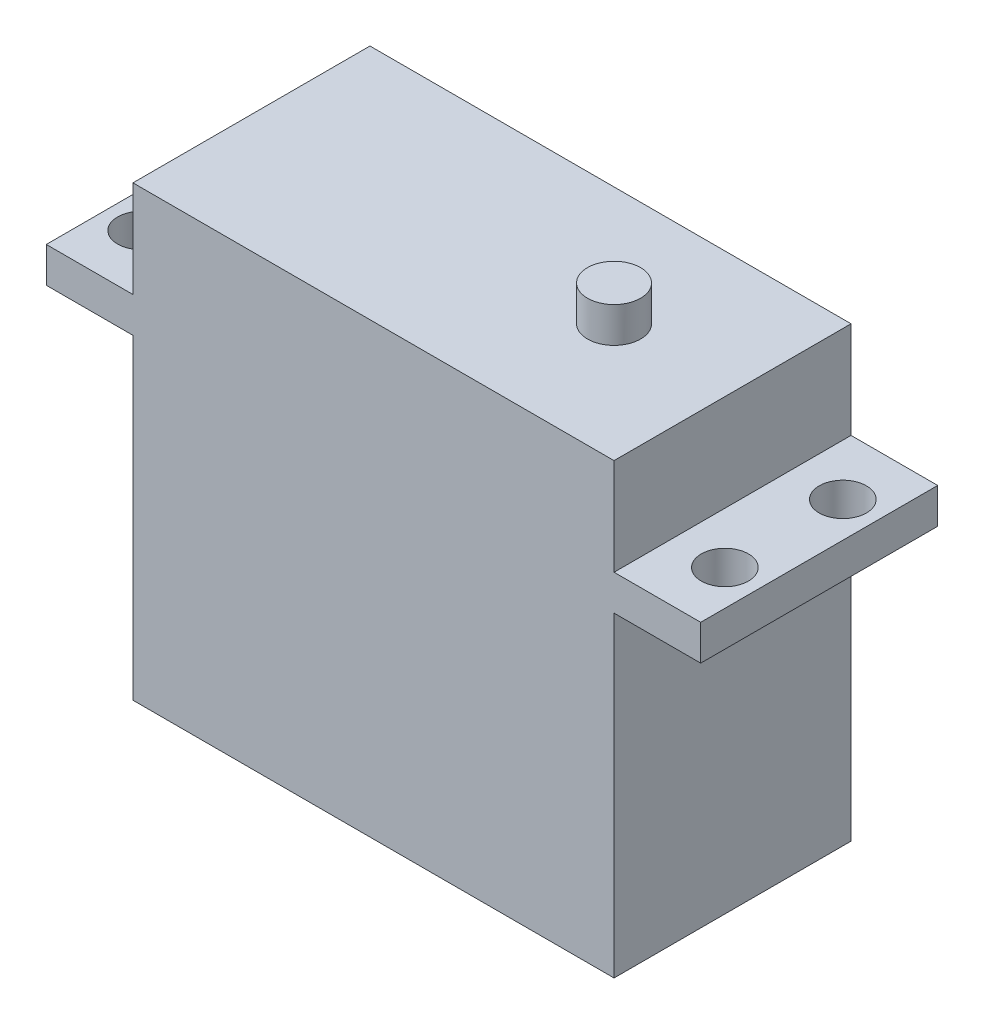
ISO-10303-21;
HEADER;
FILE_DESCRIPTION(('STEP AP214'),'2;1');
FILE_NAME('part.step','',(''),(''),'','','');
FILE_SCHEMA(('AUTOMOTIVE_DESIGN { 1 0 10303 214 1 1 1 1 }'));
ENDSEC;
DATA;
#1=APPLICATION_CONTEXT('core data for automotive mechanical design processes');
#2=APPLICATION_PROTOCOL_DEFINITION('international standard','automotive_design',2000,#1);
#3=PRODUCT_CONTEXT('',#1,'mechanical');
#4=PRODUCT('Part','Part','',(#3));
#5=PRODUCT_RELATED_PRODUCT_CATEGORY('part','',(#4));
#6=PRODUCT_DEFINITION_FORMATION('','',#4);
#7=PRODUCT_DEFINITION_CONTEXT('part definition',#1,'design');
#8=PRODUCT_DEFINITION('design','',#6,#7);
#9=PRODUCT_DEFINITION_SHAPE('','',#8);
#10=(LENGTH_UNIT() NAMED_UNIT(*) SI_UNIT(.MILLI.,.METRE.));
#11=(NAMED_UNIT(*) PLANE_ANGLE_UNIT() SI_UNIT($,.RADIAN.));
#12=(NAMED_UNIT(*) SI_UNIT($,.STERADIAN.) SOLID_ANGLE_UNIT());
#13=UNCERTAINTY_MEASURE_WITH_UNIT(LENGTH_MEASURE(1.E-05),#10,'distance_accuracy_value','');
#14=(GEOMETRIC_REPRESENTATION_CONTEXT(3) GLOBAL_UNCERTAINTY_ASSIGNED_CONTEXT((#13)) GLOBAL_UNIT_ASSIGNED_CONTEXT((#10,
#11,#12)) REPRESENTATION_CONTEXT('',''));
#15=CARTESIAN_POINT('',(0.,0.,0.));
#16=DIRECTION('',(0.,0.,1.));
#17=DIRECTION('',(1.,0.,0.));
#18=AXIS2_PLACEMENT_3D('',#15,#16,#17);
#19=CARTESIAN_POINT('',(0.,0.,20.1));
#20=DIRECTION('',(1.,0.,0.));
#21=DIRECTION('',(0.,0.,-1.));
#22=AXIS2_PLACEMENT_3D('',#19,#20,#21);
#23=PLANE('',#22);
#24=DIRECTION('',(0.,-1.,0.));
#25=VECTOR('',#24,1.);
#26=CARTESIAN_POINT('',(0.,0.,20.1));
#27=LINE('',#26,#25);
#28=CARTESIAN_POINT('',(0.,26.8,20.1));
#29=VERTEX_POINT('',#28);
#30=CARTESIAN_POINT('',(0.,0.,20.1));
#31=VERTEX_POINT('',#30);
#32=EDGE_CURVE('E183',#29,#31,#27,.T.);
#33=ORIENTED_EDGE('',*,*,#32,.F.);
#34=DIRECTION('',(0.,0.,-1.));
#35=VECTOR('',#34,1.);
#36=CARTESIAN_POINT('',(0.,26.8,20.1));
#37=LINE('',#36,#35);
#38=CARTESIAN_POINT('',(0.,26.8,0.));
#39=VERTEX_POINT('',#38);
#40=EDGE_CURVE('E173',#29,#39,#37,.T.);
#41=ORIENTED_EDGE('',*,*,#40,.T.);
#42=DIRECTION('',(0.,-1.,0.));
#43=VECTOR('',#42,1.);
#44=CARTESIAN_POINT('',(0.,0.,0.));
#45=LINE('',#44,#43);
#46=CARTESIAN_POINT('',(0.,0.,0.));
#47=VERTEX_POINT('',#46);
#48=EDGE_CURVE('E177',#39,#47,#45,.T.);
#49=ORIENTED_EDGE('',*,*,#48,.T.);
#50=DIRECTION('',(0.,0.,-1.));
#51=VECTOR('',#50,1.);
#52=CARTESIAN_POINT('',(0.,0.,20.1));
#53=LINE('',#52,#51);
#54=EDGE_CURVE('E48',#31,#47,#53,.T.);
#55=ORIENTED_EDGE('',*,*,#54,.F.);
#56=EDGE_LOOP('',(#33,#41,#49,#55));
#57=FACE_BOUND('',#56,.T.);
#58=ADVANCED_FACE('F39',(#57),#23,.F.);
#59=CARTESIAN_POINT('',(40.8,0.,20.1));
#60=DIRECTION('',(-1.,0.,0.));
#61=DIRECTION('',(0.,0.,1.));
#62=AXIS2_PLACEMENT_3D('',#59,#60,#61);
#63=PLANE('',#62);
#64=DIRECTION('',(0.,1.,0.));
#65=VECTOR('',#64,1.);
#66=CARTESIAN_POINT('',(40.8,0.,0.));
#67=LINE('',#66,#65);
#68=CARTESIAN_POINT('',(40.8,0.,0.));
#69=VERTEX_POINT('',#68);
#70=CARTESIAN_POINT('',(40.8,26.8,0.));
#71=VERTEX_POINT('',#70);
#72=EDGE_CURVE('E203',#69,#71,#67,.T.);
#73=ORIENTED_EDGE('',*,*,#72,.T.);
#74=DIRECTION('',(0.,0.,1.));
#75=VECTOR('',#74,1.);
#76=CARTESIAN_POINT('',(40.8,26.8,20.1));
#77=LINE('',#76,#75);
#78=CARTESIAN_POINT('',(40.8,26.8,20.1));
#79=VERTEX_POINT('',#78);
#80=EDGE_CURVE('E136',#71,#79,#77,.T.);
#81=ORIENTED_EDGE('',*,*,#80,.T.);
#82=DIRECTION('',(0.,1.,0.));
#83=VECTOR('',#82,1.);
#84=CARTESIAN_POINT('',(40.8,0.,20.1));
#85=LINE('',#84,#83);
#86=CARTESIAN_POINT('',(40.8,0.,20.1));
#87=VERTEX_POINT('',#86);
#88=EDGE_CURVE('E187',#87,#79,#85,.T.);
#89=ORIENTED_EDGE('',*,*,#88,.F.);
#90=DIRECTION('',(0.,0.,-1.));
#91=VECTOR('',#90,1.);
#92=CARTESIAN_POINT('',(40.8,0.,20.1));
#93=LINE('',#92,#91);
#94=EDGE_CURVE('E216',#87,#69,#93,.T.);
#95=ORIENTED_EDGE('',*,*,#94,.T.);
#96=EDGE_LOOP('',(#73,#81,#89,#95));
#97=FACE_BOUND('',#96,.T.);
#98=ADVANCED_FACE('F340',(#97),#63,.F.);
#99=CARTESIAN_POINT('',(0.,38.,0.));
#100=VERTEX_POINT('',#99);
#101=CARTESIAN_POINT('',(0.,29.8,0.));
#102=VERTEX_POINT('',#101);
#103=EDGE_CURVE('E195',#100,#102,#45,.T.);
#104=ORIENTED_EDGE('',*,*,#103,.T.);
#105=DIRECTION('',(0.,0.,1.));
#106=VECTOR('',#105,1.);
#107=CARTESIAN_POINT('',(0.,29.8,20.1));
#108=LINE('',#107,#106);
#109=CARTESIAN_POINT('',(0.,29.8,20.1));
#110=VERTEX_POINT('',#109);
#111=EDGE_CURVE('E168',#102,#110,#108,.T.);
#112=ORIENTED_EDGE('',*,*,#111,.T.);
#113=CARTESIAN_POINT('',(0.,38.,20.1));
#114=VERTEX_POINT('',#113);
#115=EDGE_CURVE('E178',#114,#110,#27,.T.);
#116=ORIENTED_EDGE('',*,*,#115,.F.);
#117=DIRECTION('',(0.,0.,-1.));
#118=VECTOR('',#117,1.);
#119=CARTESIAN_POINT('',(0.,38.,20.1));
#120=LINE('',#119,#118);
#121=EDGE_CURVE('E194',#114,#100,#120,.T.);
#122=ORIENTED_EDGE('',*,*,#121,.T.);
#123=EDGE_LOOP('',(#104,#112,#116,#122));
#124=FACE_BOUND('',#123,.T.);
#125=ADVANCED_FACE('F41',(#124),#23,.F.);
#126=CARTESIAN_POINT('',(0.,0.,20.1));
#127=DIRECTION('',(0.,1.,0.));
#128=DIRECTION('',(0.,0.,1.));
#129=AXIS2_PLACEMENT_3D('',#126,#127,#128);
#130=PLANE('',#129);
#131=DIRECTION('',(1.,0.,0.));
#132=VECTOR('',#131,1.);
#133=CARTESIAN_POINT('',(0.,0.,0.));
#134=LINE('',#133,#132);
#135=EDGE_CURVE('E199',#47,#69,#134,.T.);
#136=ORIENTED_EDGE('',*,*,#135,.T.);
#137=ORIENTED_EDGE('',*,*,#94,.F.);
#138=DIRECTION('',(1.,0.,0.));
#139=VECTOR('',#138,1.);
#140=CARTESIAN_POINT('',(0.,0.,20.1));
#141=LINE('',#140,#139);
#142=EDGE_CURVE('E182',#31,#87,#141,.T.);
#143=ORIENTED_EDGE('',*,*,#142,.F.);
#144=ORIENTED_EDGE('',*,*,#54,.T.);
#145=EDGE_LOOP('',(#136,#137,#143,#144));
#146=FACE_BOUND('',#145,.T.);
#147=ADVANCED_FACE('F337',(#146),#130,.F.);
#148=CARTESIAN_POINT('',(40.8,29.8,20.1));
#149=VERTEX_POINT('',#148);
#150=CARTESIAN_POINT('',(40.8,38.,20.1));
#151=VERTEX_POINT('',#150);
#152=EDGE_CURVE('E186',#149,#151,#85,.T.);
#153=ORIENTED_EDGE('',*,*,#152,.F.);
#154=DIRECTION('',(0.,0.,-1.));
#155=VECTOR('',#154,1.);
#156=CARTESIAN_POINT('',(40.8,29.8,20.1));
#157=LINE('',#156,#155);
#158=CARTESIAN_POINT('',(40.8,29.8,0.));
#159=VERTEX_POINT('',#158);
#160=EDGE_CURVE('E164',#149,#159,#157,.T.);
#161=ORIENTED_EDGE('',*,*,#160,.T.);
#162=CARTESIAN_POINT('',(40.8,38.,0.));
#163=VERTEX_POINT('',#162);
#164=EDGE_CURVE('E202',#159,#163,#67,.T.);
#165=ORIENTED_EDGE('',*,*,#164,.T.);
#166=DIRECTION('',(0.,0.,-1.));
#167=VECTOR('',#166,1.);
#168=CARTESIAN_POINT('',(40.8,38.,20.1));
#169=LINE('',#168,#167);
#170=EDGE_CURVE('E212',#151,#163,#169,.T.);
#171=ORIENTED_EDGE('',*,*,#170,.F.);
#172=EDGE_LOOP('',(#153,#161,#165,#171));
#173=FACE_BOUND('',#172,.T.);
#174=ADVANCED_FACE('F312',(#173),#63,.F.);
#175=CARTESIAN_POINT('',(0.,38.,20.1));
#176=DIRECTION('',(0.,-1.,0.));
#177=DIRECTION('',(0.,0.,-1.));
#178=AXIS2_PLACEMENT_3D('',#175,#176,#177);
#179=PLANE('',#178);
#180=CARTESIAN_POINT('',(30.75,38.,10.05));
#181=DIRECTION('',(0.,-1.,0.));
#182=DIRECTION('',(0.,0.,-1.));
#183=AXIS2_PLACEMENT_3D('',#180,#181,#182);
#184=CIRCLE('',#183,2.25);
#185=CARTESIAN_POINT('',(30.75,38.,7.8));
#186=VERTEX_POINT('',#185);
#187=EDGE_CURVE('E11',#186,#186,#184,.F.);
#188=ORIENTED_EDGE('',*,*,#187,.F.);
#189=EDGE_LOOP('',(#188));
#190=FACE_BOUND('',#189,.T.);
#191=DIRECTION('',(-1.,0.,0.));
#192=VECTOR('',#191,1.);
#193=CARTESIAN_POINT('',(0.,38.,0.));
#194=LINE('',#193,#192);
#195=EDGE_CURVE('E206',#163,#100,#194,.T.);
#196=ORIENTED_EDGE('',*,*,#195,.T.);
#197=ORIENTED_EDGE('',*,*,#121,.F.);
#198=DIRECTION('',(-1.,0.,0.));
#199=VECTOR('',#198,1.);
#200=CARTESIAN_POINT('',(0.,38.,20.1));
#201=LINE('',#200,#199);
#202=EDGE_CURVE('E191',#151,#114,#201,.T.);
#203=ORIENTED_EDGE('',*,*,#202,.F.);
#204=ORIENTED_EDGE('',*,*,#170,.T.);
#205=EDGE_LOOP('',(#196,#197,#203,#204));
#206=FACE_BOUND('',#205,.T.);
#207=ADVANCED_FACE('F308',(#190,#206),#179,.F.);
#208=CARTESIAN_POINT('',(0.,0.,20.1));
#209=DIRECTION('',(0.,0.,-1.));
#210=DIRECTION('',(-1.,0.,0.));
#211=AXIS2_PLACEMENT_3D('',#208,#209,#210);
#212=PLANE('',#211);
#213=ORIENTED_EDGE('',*,*,#115,.T.);
#214=DIRECTION('',(-1.,0.,0.));
#215=VECTOR('',#214,1.);
#216=CARTESIAN_POINT('',(-7.35,29.8,20.1));
#217=LINE('',#216,#215);
#218=CARTESIAN_POINT('',(-7.35,29.8,20.1));
#219=VERTEX_POINT('',#218);
#220=EDGE_CURVE('E55',#110,#219,#217,.T.);
#221=ORIENTED_EDGE('',*,*,#220,.T.);
#222=DIRECTION('',(0.,-1.,0.));
#223=VECTOR('',#222,1.);
#224=CARTESIAN_POINT('',(-7.35,29.8,20.1));
#225=LINE('',#224,#223);
#226=CARTESIAN_POINT('',(-7.35,26.8,20.1));
#227=VERTEX_POINT('',#226);
#228=EDGE_CURVE('E230',#219,#227,#225,.T.);
#229=ORIENTED_EDGE('',*,*,#228,.T.);
#230=DIRECTION('',(1.,0.,0.));
#231=VECTOR('',#230,1.);
#232=CARTESIAN_POINT('',(-7.35,26.8,20.1));
#233=LINE('',#232,#231);
#234=EDGE_CURVE('E241',#227,#29,#233,.T.);
#235=ORIENTED_EDGE('',*,*,#234,.T.);
#236=ORIENTED_EDGE('',*,*,#32,.T.);
#237=ORIENTED_EDGE('',*,*,#142,.T.);
#238=ORIENTED_EDGE('',*,*,#88,.T.);
#239=CARTESIAN_POINT('',(48.15,26.8,20.1));
#240=VERTEX_POINT('',#239);
#241=EDGE_CURVE('E235',#79,#240,#233,.T.);
#242=ORIENTED_EDGE('',*,*,#241,.T.);
#243=DIRECTION('',(0.,1.,0.));
#244=VECTOR('',#243,1.);
#245=CARTESIAN_POINT('',(48.15,29.8,20.1));
#246=LINE('',#245,#244);
#247=CARTESIAN_POINT('',(48.15,29.8,20.1));
#248=VERTEX_POINT('',#247);
#249=EDGE_CURVE('E154',#240,#248,#246,.T.);
#250=ORIENTED_EDGE('',*,*,#249,.T.);
#251=EDGE_CURVE('E142',#248,#149,#217,.T.);
#252=ORIENTED_EDGE('',*,*,#251,.T.);
#253=ORIENTED_EDGE('',*,*,#152,.T.);
#254=ORIENTED_EDGE('',*,*,#202,.T.);
#255=EDGE_LOOP('',(#213,#221,#229,#235,#236,#237,#238,#242,#250,#252,#253,#254));
#256=FACE_BOUND('',#255,.T.);
#257=ADVANCED_FACE('F311',(#256),#212,.F.);
#258=CARTESIAN_POINT('',(0.,0.,0.));
#259=DIRECTION('',(0.,0.,-1.));
#260=DIRECTION('',(-1.,0.,0.));
#261=AXIS2_PLACEMENT_3D('',#258,#259,#260);
#262=PLANE('',#261);
#263=ORIENTED_EDGE('',*,*,#164,.F.);
#264=DIRECTION('',(-1.,0.,0.));
#265=VECTOR('',#264,1.);
#266=CARTESIAN_POINT('',(-7.35,29.8,0.));
#267=LINE('',#266,#265);
#268=CARTESIAN_POINT('',(48.15,29.8,0.));
#269=VERTEX_POINT('',#268);
#270=EDGE_CURVE('E63',#269,#159,#267,.T.);
#271=ORIENTED_EDGE('',*,*,#270,.F.);
#272=DIRECTION('',(0.,1.,0.));
#273=VECTOR('',#272,1.);
#274=CARTESIAN_POINT('',(48.15,29.8,0.));
#275=LINE('',#274,#273);
#276=CARTESIAN_POINT('',(48.15,26.8,0.));
#277=VERTEX_POINT('',#276);
#278=EDGE_CURVE('E145',#277,#269,#275,.T.);
#279=ORIENTED_EDGE('',*,*,#278,.F.);
#280=DIRECTION('',(1.,0.,0.));
#281=VECTOR('',#280,1.);
#282=CARTESIAN_POINT('',(-7.35,26.8,0.));
#283=LINE('',#282,#281);
#284=EDGE_CURVE('E129',#71,#277,#283,.T.);
#285=ORIENTED_EDGE('',*,*,#284,.F.);
#286=ORIENTED_EDGE('',*,*,#72,.F.);
#287=ORIENTED_EDGE('',*,*,#135,.F.);
#288=ORIENTED_EDGE('',*,*,#48,.F.);
#289=CARTESIAN_POINT('',(-7.35,26.8,0.));
#290=VERTEX_POINT('',#289);
#291=EDGE_CURVE('E141',#290,#39,#283,.T.);
#292=ORIENTED_EDGE('',*,*,#291,.F.);
#293=DIRECTION('',(0.,-1.,0.));
#294=VECTOR('',#293,1.);
#295=CARTESIAN_POINT('',(-7.35,29.8,0.));
#296=LINE('',#295,#294);
#297=CARTESIAN_POINT('',(-7.35,29.8,0.));
#298=VERTEX_POINT('',#297);
#299=EDGE_CURVE('E165',#298,#290,#296,.T.);
#300=ORIENTED_EDGE('',*,*,#299,.F.);
#301=EDGE_CURVE('E250',#102,#298,#267,.T.);
#302=ORIENTED_EDGE('',*,*,#301,.F.);
#303=ORIENTED_EDGE('',*,*,#103,.F.);
#304=ORIENTED_EDGE('',*,*,#195,.F.);
#305=EDGE_LOOP('',(#263,#271,#279,#285,#286,#287,#288,#292,#300,#302,#303,#304));
#306=FACE_BOUND('',#305,.T.);
#307=ADVANCED_FACE('F147',(#306),#262,.T.);
#308=CARTESIAN_POINT('',(48.15,29.8,-55.5810219409467));
#309=DIRECTION('',(1.,0.,0.));
#310=DIRECTION('',(0.,0.,-1.));
#311=AXIS2_PLACEMENT_3D('',#308,#309,#310);
#312=PLANE('',#311);
#313=DIRECTION('',(0.,0.,1.));
#314=VECTOR('',#313,1.);
#315=CARTESIAN_POINT('',(48.15,26.8,-55.5810219409467));
#316=LINE('',#315,#314);
#317=EDGE_CURVE('E133',#277,#240,#316,.T.);
#318=ORIENTED_EDGE('',*,*,#317,.F.);
#319=ORIENTED_EDGE('',*,*,#278,.T.);
#320=DIRECTION('',(0.,0.,1.));
#321=VECTOR('',#320,1.);
#322=CARTESIAN_POINT('',(48.15,29.8,-55.5810219409467));
#323=LINE('',#322,#321);
#324=EDGE_CURVE('E150',#269,#248,#323,.T.);
#325=ORIENTED_EDGE('',*,*,#324,.T.);
#326=ORIENTED_EDGE('',*,*,#249,.F.);
#327=EDGE_LOOP('',(#318,#319,#325,#326));
#328=FACE_BOUND('',#327,.T.);
#329=ADVANCED_FACE('F152',(#328),#312,.T.);
#330=CARTESIAN_POINT('',(-7.35,29.8,-55.5810219409467));
#331=DIRECTION('',(0.,1.,0.));
#332=DIRECTION('',(-1.,0.,0.));
#333=AXIS2_PLACEMENT_3D('',#330,#331,#332);
#334=PLANE('',#333);
#335=CARTESIAN_POINT('',(45.15,29.8,5.05));
#336=DIRECTION('',(0.,1.,0.));
#337=DIRECTION('',(-1.,0.,0.));
#338=AXIS2_PLACEMENT_3D('',#335,#336,#337);
#339=CIRCLE('',#338,2.);
#340=CARTESIAN_POINT('',(43.15,29.8,5.05));
#341=VERTEX_POINT('',#340);
#342=EDGE_CURVE('E283',#341,#341,#339,.T.);
#343=ORIENTED_EDGE('',*,*,#342,.F.);
#344=EDGE_LOOP('',(#343));
#345=FACE_BOUND('',#344,.T.);
#346=CARTESIAN_POINT('',(45.15,29.8,15.05));
#347=DIRECTION('',(0.,1.,0.));
#348=DIRECTION('',(-1.,0.,0.));
#349=AXIS2_PLACEMENT_3D('',#346,#347,#348);
#350=CIRCLE('',#349,2.);
#351=CARTESIAN_POINT('',(43.15,29.8,15.05));
#352=VERTEX_POINT('',#351);
#353=EDGE_CURVE('E287',#352,#352,#350,.T.);
#354=ORIENTED_EDGE('',*,*,#353,.F.);
#355=EDGE_LOOP('',(#354));
#356=FACE_BOUND('',#355,.T.);
#357=ORIENTED_EDGE('',*,*,#160,.F.);
#358=ORIENTED_EDGE('',*,*,#251,.F.);
#359=ORIENTED_EDGE('',*,*,#324,.F.);
#360=ORIENTED_EDGE('',*,*,#270,.T.);
#361=EDGE_LOOP('',(#357,#358,#359,#360));
#362=FACE_BOUND('',#361,.T.);
#363=ADVANCED_FACE('F323',(#345,#356,#362),#334,.T.);
#364=CARTESIAN_POINT('',(-7.35,26.8,-55.5810219409467));
#365=DIRECTION('',(0.,-1.,0.));
#366=DIRECTION('',(1.,0.,0.));
#367=AXIS2_PLACEMENT_3D('',#364,#365,#366);
#368=PLANE('',#367);
#369=CARTESIAN_POINT('',(45.15,26.8,5.05));
#370=DIRECTION('',(0.,-1.,0.));
#371=DIRECTION('',(1.,0.,0.));
#372=AXIS2_PLACEMENT_3D('',#369,#370,#371);
#373=CIRCLE('',#372,2.);
#374=CARTESIAN_POINT('',(47.15,26.8,5.05));
#375=VERTEX_POINT('',#374);
#376=EDGE_CURVE('E226',#375,#375,#373,.T.);
#377=ORIENTED_EDGE('',*,*,#376,.F.);
#378=EDGE_LOOP('',(#377));
#379=FACE_BOUND('',#378,.T.);
#380=CARTESIAN_POINT('',(45.15,26.8,15.05));
#381=DIRECTION('',(0.,-1.,0.));
#382=DIRECTION('',(1.,0.,0.));
#383=AXIS2_PLACEMENT_3D('',#380,#381,#382);
#384=CIRCLE('',#383,2.);
#385=CARTESIAN_POINT('',(47.15,26.8,15.05));
#386=VERTEX_POINT('',#385);
#387=EDGE_CURVE('E223',#386,#386,#384,.T.);
#388=ORIENTED_EDGE('',*,*,#387,.F.);
#389=EDGE_LOOP('',(#388));
#390=FACE_BOUND('',#389,.T.);
#391=ORIENTED_EDGE('',*,*,#80,.F.);
#392=ORIENTED_EDGE('',*,*,#284,.T.);
#393=ORIENTED_EDGE('',*,*,#317,.T.);
#394=ORIENTED_EDGE('',*,*,#241,.F.);
#395=EDGE_LOOP('',(#391,#392,#393,#394));
#396=FACE_BOUND('',#395,.T.);
#397=ADVANCED_FACE('F131',(#379,#390,#396),#368,.T.);
#398=CARTESIAN_POINT('',(-4.35,26.8,15.05));
#399=DIRECTION('',(0.,-1.,0.));
#400=DIRECTION('',(1.,0.,0.));
#401=AXIS2_PLACEMENT_3D('',#398,#399,#400);
#402=CIRCLE('',#401,2.);
#403=CARTESIAN_POINT('',(-2.35,26.8,15.05));
#404=VERTEX_POINT('',#403);
#405=EDGE_CURVE('E227',#404,#404,#402,.T.);
#406=ORIENTED_EDGE('',*,*,#405,.F.);
#407=EDGE_LOOP('',(#406));
#408=FACE_BOUND('',#407,.T.);
#409=CARTESIAN_POINT('',(-4.35,26.8,5.05));
#410=DIRECTION('',(0.,-1.,0.));
#411=DIRECTION('',(1.,0.,0.));
#412=AXIS2_PLACEMENT_3D('',#409,#410,#411);
#413=CIRCLE('',#412,2.);
#414=CARTESIAN_POINT('',(-2.35,26.8,5.05));
#415=VERTEX_POINT('',#414);
#416=EDGE_CURVE('E274',#415,#415,#413,.T.);
#417=ORIENTED_EDGE('',*,*,#416,.F.);
#418=EDGE_LOOP('',(#417));
#419=FACE_BOUND('',#418,.T.);
#420=ORIENTED_EDGE('',*,*,#40,.F.);
#421=ORIENTED_EDGE('',*,*,#234,.F.);
#422=DIRECTION('',(0.,0.,1.));
#423=VECTOR('',#422,1.);
#424=CARTESIAN_POINT('',(-7.35,26.8,-55.5810219409467));
#425=LINE('',#424,#423);
#426=EDGE_CURVE('E161',#290,#227,#425,.T.);
#427=ORIENTED_EDGE('',*,*,#426,.F.);
#428=ORIENTED_EDGE('',*,*,#291,.T.);
#429=EDGE_LOOP('',(#420,#421,#427,#428));
#430=FACE_BOUND('',#429,.T.);
#431=ADVANCED_FACE('F261',(#408,#419,#430),#368,.T.);
#432=CARTESIAN_POINT('',(-4.35,29.8,15.05));
#433=DIRECTION('',(0.,1.,0.));
#434=DIRECTION('',(-1.,0.,0.));
#435=AXIS2_PLACEMENT_3D('',#432,#433,#434);
#436=CIRCLE('',#435,2.);
#437=CARTESIAN_POINT('',(-6.35,29.8,15.05));
#438=VERTEX_POINT('',#437);
#439=EDGE_CURVE('E282',#438,#438,#436,.T.);
#440=ORIENTED_EDGE('',*,*,#439,.F.);
#441=EDGE_LOOP('',(#440));
#442=FACE_BOUND('',#441,.T.);
#443=CARTESIAN_POINT('',(-4.35,29.8,5.05));
#444=DIRECTION('',(0.,1.,0.));
#445=DIRECTION('',(-1.,0.,0.));
#446=AXIS2_PLACEMENT_3D('',#443,#444,#445);
#447=CIRCLE('',#446,2.);
#448=CARTESIAN_POINT('',(-6.35,29.8,5.05));
#449=VERTEX_POINT('',#448);
#450=EDGE_CURVE('E278',#449,#449,#447,.T.);
#451=ORIENTED_EDGE('',*,*,#450,.F.);
#452=EDGE_LOOP('',(#451));
#453=FACE_BOUND('',#452,.T.);
#454=ORIENTED_EDGE('',*,*,#111,.F.);
#455=ORIENTED_EDGE('',*,*,#301,.T.);
#456=DIRECTION('',(0.,0.,1.));
#457=VECTOR('',#456,1.);
#458=CARTESIAN_POINT('',(-7.35,29.8,-55.5810219409467));
#459=LINE('',#458,#457);
#460=EDGE_CURVE('E248',#298,#219,#459,.T.);
#461=ORIENTED_EDGE('',*,*,#460,.T.);
#462=ORIENTED_EDGE('',*,*,#220,.F.);
#463=EDGE_LOOP('',(#454,#455,#461,#462));
#464=FACE_BOUND('',#463,.T.);
#465=ADVANCED_FACE('F253',(#442,#453,#464),#334,.T.);
#466=CARTESIAN_POINT('',(-7.35,29.8,-55.5810219409467));
#467=DIRECTION('',(-1.,0.,0.));
#468=DIRECTION('',(0.,0.,1.));
#469=AXIS2_PLACEMENT_3D('',#466,#467,#468);
#470=PLANE('',#469);
#471=ORIENTED_EDGE('',*,*,#460,.F.);
#472=ORIENTED_EDGE('',*,*,#299,.T.);
#473=ORIENTED_EDGE('',*,*,#426,.T.);
#474=ORIENTED_EDGE('',*,*,#228,.F.);
#475=EDGE_LOOP('',(#471,#472,#473,#474));
#476=FACE_BOUND('',#475,.T.);
#477=ADVANCED_FACE('F257',(#476),#470,.T.);
#478=CARTESIAN_POINT('',(-4.35,0.,5.05));
#479=DIRECTION('',(0.,1.,0.));
#480=DIRECTION('',(-1.,0.,0.));
#481=AXIS2_PLACEMENT_3D('',#478,#479,#480);
#482=CYLINDRICAL_SURFACE('',#481,2.);
#483=ORIENTED_EDGE('',*,*,#416,.T.);
#484=EDGE_LOOP('',(#483));
#485=FACE_BOUND('',#484,.T.);
#486=ORIENTED_EDGE('',*,*,#450,.T.);
#487=EDGE_LOOP('',(#486));
#488=FACE_BOUND('',#487,.T.);
#489=ADVANCED_FACE('F403',(#485,#488),#482,.F.);
#490=CARTESIAN_POINT('',(-4.35,0.,15.05));
#491=DIRECTION('',(0.,1.,0.));
#492=DIRECTION('',(-1.,0.,0.));
#493=AXIS2_PLACEMENT_3D('',#490,#491,#492);
#494=CYLINDRICAL_SURFACE('',#493,2.);
#495=ORIENTED_EDGE('',*,*,#405,.T.);
#496=EDGE_LOOP('',(#495));
#497=FACE_BOUND('',#496,.T.);
#498=ORIENTED_EDGE('',*,*,#439,.T.);
#499=EDGE_LOOP('',(#498));
#500=FACE_BOUND('',#499,.T.);
#501=ADVANCED_FACE('F444',(#497,#500),#494,.F.);
#502=CARTESIAN_POINT('',(45.15,0.,15.05));
#503=DIRECTION('',(0.,1.,0.));
#504=DIRECTION('',(-1.,0.,0.));
#505=AXIS2_PLACEMENT_3D('',#502,#503,#504);
#506=CYLINDRICAL_SURFACE('',#505,2.);
#507=ORIENTED_EDGE('',*,*,#387,.T.);
#508=EDGE_LOOP('',(#507));
#509=FACE_BOUND('',#508,.T.);
#510=ORIENTED_EDGE('',*,*,#353,.T.);
#511=EDGE_LOOP('',(#510));
#512=FACE_BOUND('',#511,.T.);
#513=ADVANCED_FACE('F454',(#509,#512),#506,.F.);
#514=CARTESIAN_POINT('',(45.15,0.,5.05));
#515=DIRECTION('',(0.,1.,0.));
#516=DIRECTION('',(-1.,0.,0.));
#517=AXIS2_PLACEMENT_3D('',#514,#515,#516);
#518=CYLINDRICAL_SURFACE('',#517,2.);
#519=ORIENTED_EDGE('',*,*,#376,.T.);
#520=EDGE_LOOP('',(#519));
#521=FACE_BOUND('',#520,.T.);
#522=ORIENTED_EDGE('',*,*,#342,.T.);
#523=EDGE_LOOP('',(#522));
#524=FACE_BOUND('',#523,.T.);
#525=ADVANCED_FACE('F304',(#521,#524),#518,.F.);
#526=CARTESIAN_POINT('',(30.75,41.,10.05));
#527=DIRECTION('',(0.,-1.,0.));
#528=DIRECTION('',(0.,0.,-1.));
#529=AXIS2_PLACEMENT_3D('',#526,#527,#528);
#530=CYLINDRICAL_SURFACE('',#529,2.25);
#531=CARTESIAN_POINT('',(30.75,41.,10.05));
#532=DIRECTION('',(0.,1.,0.));
#533=DIRECTION('',(0.,0.,1.));
#534=AXIS2_PLACEMENT_3D('',#531,#532,#533);
#535=CIRCLE('',#534,2.25);
#536=CARTESIAN_POINT('',(30.75,41.,12.3));
#537=VERTEX_POINT('',#536);
#538=EDGE_CURVE('E288',#537,#537,#535,.T.);
#539=ORIENTED_EDGE('',*,*,#538,.F.);
#540=EDGE_LOOP('',(#539));
#541=FACE_BOUND('',#540,.T.);
#542=ORIENTED_EDGE('',*,*,#187,.T.);
#543=EDGE_LOOP('',(#542));
#544=FACE_BOUND('',#543,.T.);
#545=ADVANCED_FACE('F301',(#541,#544),#530,.T.);
#546=CARTESIAN_POINT('',(30.75,41.,10.05));
#547=DIRECTION('',(0.,1.,0.));
#548=DIRECTION('',(0.,0.,1.));
#549=AXIS2_PLACEMENT_3D('',#546,#547,#548);
#550=PLANE('',#549);
#551=ORIENTED_EDGE('',*,*,#538,.T.);
#552=EDGE_LOOP('',(#551));
#553=FACE_BOUND('',#552,.T.);
#554=ADVANCED_FACE('F299',(#553),#550,.T.);
#555=CLOSED_SHELL('',(#58,#98,#125,#147,#174,#207,#257,#307,#329,#363,#397,#431,#465,#477,#489,
#501,#513,#525,#545,#554));
#556=MANIFOLD_SOLID_BREP('B2',#555);
#557=ADVANCED_BREP_SHAPE_REPRESENTATION('',(#18,#556),#14);
#558=SHAPE_DEFINITION_REPRESENTATION(#9,#557);
ENDSEC;
END-ISO-10303-21;
